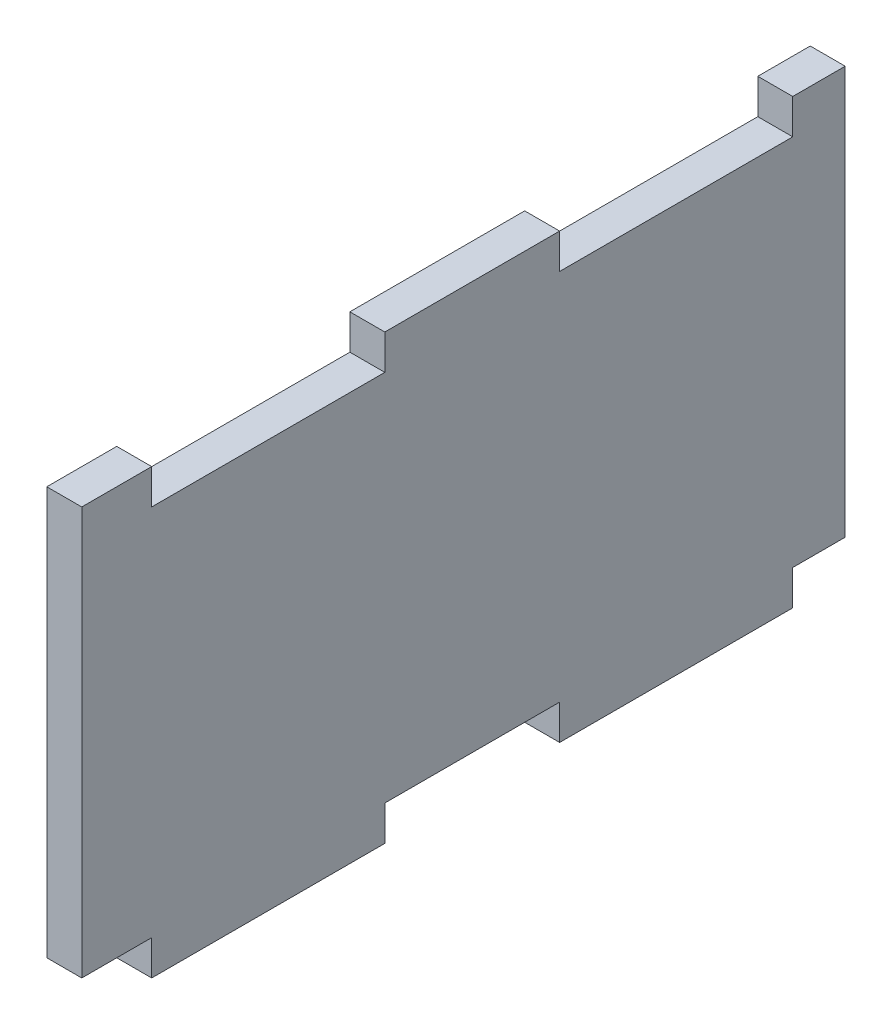
ISO-10303-21;
HEADER;
FILE_DESCRIPTION(('STEP AP214'),'2;1');
FILE_NAME('part.step','',(''),(''),'','','');
FILE_SCHEMA(('AUTOMOTIVE_DESIGN { 1 0 10303 214 1 1 1 1 }'));
ENDSEC;
DATA;
#1=APPLICATION_CONTEXT('core data for automotive mechanical design processes');
#2=APPLICATION_PROTOCOL_DEFINITION('international standard','automotive_design',2000,#1);
#3=PRODUCT_CONTEXT('',#1,'mechanical');
#4=PRODUCT('Part','Part','',(#3));
#5=PRODUCT_RELATED_PRODUCT_CATEGORY('part','',(#4));
#6=PRODUCT_DEFINITION_FORMATION('','',#4);
#7=PRODUCT_DEFINITION_CONTEXT('part definition',#1,'design');
#8=PRODUCT_DEFINITION('design','',#6,#7);
#9=PRODUCT_DEFINITION_SHAPE('','',#8);
#10=(LENGTH_UNIT() NAMED_UNIT(*) SI_UNIT(.MILLI.,.METRE.));
#11=(NAMED_UNIT(*) PLANE_ANGLE_UNIT() SI_UNIT($,.RADIAN.));
#12=(NAMED_UNIT(*) SI_UNIT($,.STERADIAN.) SOLID_ANGLE_UNIT());
#13=UNCERTAINTY_MEASURE_WITH_UNIT(LENGTH_MEASURE(1.E-05),#10,'distance_accuracy_value','');
#14=(GEOMETRIC_REPRESENTATION_CONTEXT(3) GLOBAL_UNCERTAINTY_ASSIGNED_CONTEXT((#13)) GLOBAL_UNIT_ASSIGNED_CONTEXT((#10,
#11,#12)) REPRESENTATION_CONTEXT('',''));
#15=CARTESIAN_POINT('',(0.,0.,0.));
#16=DIRECTION('',(0.,0.,1.));
#17=DIRECTION('',(1.,0.,0.));
#18=AXIS2_PLACEMENT_3D('',#15,#16,#17);
#19=CARTESIAN_POINT('',(3.,0.,0.));
#20=DIRECTION('',(0.,0.,1.));
#21=DIRECTION('',(1.,0.,0.));
#22=AXIS2_PLACEMENT_3D('',#19,#20,#21);
#23=PLANE('',#22);
#24=DIRECTION('',(0.,1.,0.));
#25=VECTOR('',#24,1.);
#26=CARTESIAN_POINT('',(0.,0.,0.));
#27=LINE('',#26,#25);
#28=CARTESIAN_POINT('',(0.,0.,0.));
#29=VERTEX_POINT('',#28);
#30=CARTESIAN_POINT('',(0.,35.,0.));
#31=VERTEX_POINT('',#30);
#32=EDGE_CURVE('E206',#29,#31,#27,.T.);
#33=ORIENTED_EDGE('',*,*,#32,.F.);
#34=DIRECTION('',(-1.,0.,0.));
#35=VECTOR('',#34,1.);
#36=CARTESIAN_POINT('',(3.,0.,0.));
#37=LINE('',#36,#35);
#38=CARTESIAN_POINT('',(3.,0.,0.));
#39=VERTEX_POINT('',#38);
#40=EDGE_CURVE('E42',#39,#29,#37,.T.);
#41=ORIENTED_EDGE('',*,*,#40,.F.);
#42=DIRECTION('',(0.,1.,0.));
#43=VECTOR('',#42,1.);
#44=CARTESIAN_POINT('',(3.,0.,0.));
#45=LINE('',#44,#43);
#46=CARTESIAN_POINT('',(3.,35.,0.));
#47=VERTEX_POINT('',#46);
#48=EDGE_CURVE('E257',#39,#47,#45,.T.);
#49=ORIENTED_EDGE('',*,*,#48,.T.);
#50=DIRECTION('',(-1.,0.,0.));
#51=VECTOR('',#50,1.);
#52=CARTESIAN_POINT('',(3.,35.,0.));
#53=LINE('',#52,#51);
#54=EDGE_CURVE('E124',#47,#31,#53,.T.);
#55=ORIENTED_EDGE('',*,*,#54,.T.);
#56=EDGE_LOOP('',(#33,#41,#49,#55));
#57=FACE_BOUND('',#56,.T.);
#58=ADVANCED_FACE('F35',(#57),#23,.T.);
#59=CARTESIAN_POINT('',(3.,0.,0.));
#60=DIRECTION('',(0.,1.,0.));
#61=DIRECTION('',(0.,0.,1.));
#62=AXIS2_PLACEMENT_3D('',#59,#60,#61);
#63=PLANE('',#62);
#64=DIRECTION('',(0.,0.,-1.));
#65=VECTOR('',#64,1.);
#66=CARTESIAN_POINT('',(0.,0.,0.));
#67=LINE('',#66,#65);
#68=CARTESIAN_POINT('',(0.,0.,-6.));
#69=VERTEX_POINT('',#68);
#70=EDGE_CURVE('E255',#29,#69,#67,.T.);
#71=ORIENTED_EDGE('',*,*,#70,.T.);
#72=DIRECTION('',(-1.,0.,0.));
#73=VECTOR('',#72,1.);
#74=CARTESIAN_POINT('',(3.,0.,-6.));
#75=LINE('',#74,#73);
#76=CARTESIAN_POINT('',(3.,0.,-6.));
#77=VERTEX_POINT('',#76);
#78=EDGE_CURVE('E194',#77,#69,#75,.T.);
#79=ORIENTED_EDGE('',*,*,#78,.F.);
#80=DIRECTION('',(0.,0.,-1.));
#81=VECTOR('',#80,1.);
#82=CARTESIAN_POINT('',(3.,0.,0.));
#83=LINE('',#82,#81);
#84=EDGE_CURVE('E181',#39,#77,#83,.T.);
#85=ORIENTED_EDGE('',*,*,#84,.F.);
#86=ORIENTED_EDGE('',*,*,#40,.T.);
#87=EDGE_LOOP('',(#71,#79,#85,#86));
#88=FACE_BOUND('',#87,.T.);
#89=ADVANCED_FACE('F292',(#88),#63,.F.);
#90=CARTESIAN_POINT('',(3.,0.,-6.));
#91=DIRECTION('',(0.,0.,-1.));
#92=DIRECTION('',(-1.,0.,0.));
#93=AXIS2_PLACEMENT_3D('',#90,#91,#92);
#94=PLANE('',#93);
#95=DIRECTION('',(0.,-1.,0.));
#96=VECTOR('',#95,1.);
#97=CARTESIAN_POINT('',(0.,0.,-6.));
#98=LINE('',#97,#96);
#99=CARTESIAN_POINT('',(0.,-3.00000000000001,-6.));
#100=VERTEX_POINT('',#99);
#101=EDGE_CURVE('E190',#69,#100,#98,.T.);
#102=ORIENTED_EDGE('',*,*,#101,.T.);
#103=DIRECTION('',(-1.,0.,0.));
#104=VECTOR('',#103,1.);
#105=CARTESIAN_POINT('',(3.,-3.00000000000001,-6.));
#106=LINE('',#105,#104);
#107=CARTESIAN_POINT('',(3.,-3.00000000000001,-6.));
#108=VERTEX_POINT('',#107);
#109=EDGE_CURVE('E187',#108,#100,#106,.T.);
#110=ORIENTED_EDGE('',*,*,#109,.F.);
#111=DIRECTION('',(0.,-1.,0.));
#112=VECTOR('',#111,1.);
#113=CARTESIAN_POINT('',(3.,0.,-6.));
#114=LINE('',#113,#112);
#115=EDGE_CURVE('E172',#77,#108,#114,.T.);
#116=ORIENTED_EDGE('',*,*,#115,.F.);
#117=ORIENTED_EDGE('',*,*,#78,.T.);
#118=EDGE_LOOP('',(#102,#110,#116,#117));
#119=FACE_BOUND('',#118,.T.);
#120=ADVANCED_FACE('F188',(#119),#94,.F.);
#121=CARTESIAN_POINT('',(3.,-3.00000000000001,-6.));
#122=DIRECTION('',(0.,1.,0.));
#123=DIRECTION('',(0.,0.,1.));
#124=AXIS2_PLACEMENT_3D('',#121,#122,#123);
#125=PLANE('',#124);
#126=DIRECTION('',(0.,0.,-1.));
#127=VECTOR('',#126,1.);
#128=CARTESIAN_POINT('',(0.,-3.00000000000001,-6.));
#129=LINE('',#128,#127);
#130=CARTESIAN_POINT('',(0.,-3.,-26.));
#131=VERTEX_POINT('',#130);
#132=EDGE_CURVE('E252',#100,#131,#129,.T.);
#133=ORIENTED_EDGE('',*,*,#132,.T.);
#134=DIRECTION('',(-1.,0.,0.));
#135=VECTOR('',#134,1.);
#136=CARTESIAN_POINT('',(3.,-3.,-26.));
#137=LINE('',#136,#135);
#138=CARTESIAN_POINT('',(3.,-3.,-26.));
#139=VERTEX_POINT('',#138);
#140=EDGE_CURVE('E195',#139,#131,#137,.T.);
#141=ORIENTED_EDGE('',*,*,#140,.F.);
#142=DIRECTION('',(0.,0.,-1.));
#143=VECTOR('',#142,1.);
#144=CARTESIAN_POINT('',(3.,-3.00000000000001,-6.));
#145=LINE('',#144,#143);
#146=EDGE_CURVE('E178',#108,#139,#145,.T.);
#147=ORIENTED_EDGE('',*,*,#146,.F.);
#148=ORIENTED_EDGE('',*,*,#109,.T.);
#149=EDGE_LOOP('',(#133,#141,#147,#148));
#150=FACE_BOUND('',#149,.T.);
#151=ADVANCED_FACE('F197',(#150),#125,.F.);
#152=CARTESIAN_POINT('',(3.,0.,-26.));
#153=DIRECTION('',(0.,0.,-1.));
#154=DIRECTION('',(0.,1.,0.));
#155=AXIS2_PLACEMENT_3D('',#152,#153,#154);
#156=PLANE('',#155);
#157=DIRECTION('',(0.,-1.,0.));
#158=VECTOR('',#157,1.);
#159=CARTESIAN_POINT('',(0.,0.,-26.));
#160=LINE('',#159,#158);
#161=CARTESIAN_POINT('',(0.,0.,-26.));
#162=VERTEX_POINT('',#161);
#163=EDGE_CURVE('E249',#162,#131,#160,.T.);
#164=ORIENTED_EDGE('',*,*,#163,.F.);
#165=DIRECTION('',(-1.,0.,0.));
#166=VECTOR('',#165,1.);
#167=CARTESIAN_POINT('',(3.,0.,-26.));
#168=LINE('',#167,#166);
#169=CARTESIAN_POINT('',(3.,0.,-26.));
#170=VERTEX_POINT('',#169);
#171=EDGE_CURVE('E261',#170,#162,#168,.T.);
#172=ORIENTED_EDGE('',*,*,#171,.F.);
#173=DIRECTION('',(0.,-1.,0.));
#174=VECTOR('',#173,1.);
#175=CARTESIAN_POINT('',(3.,0.,-26.));
#176=LINE('',#175,#174);
#177=EDGE_CURVE('E199',#170,#139,#176,.T.);
#178=ORIENTED_EDGE('',*,*,#177,.T.);
#179=ORIENTED_EDGE('',*,*,#140,.T.);
#180=EDGE_LOOP('',(#164,#172,#178,#179));
#181=FACE_BOUND('',#180,.T.);
#182=ADVANCED_FACE('F417',(#181),#156,.T.);
#183=CARTESIAN_POINT('',(3.,0.,-26.));
#184=DIRECTION('',(0.,1.,0.));
#185=DIRECTION('',(0.,0.,1.));
#186=AXIS2_PLACEMENT_3D('',#183,#184,#185);
#187=PLANE('',#186);
#188=DIRECTION('',(0.,0.,-1.));
#189=VECTOR('',#188,1.);
#190=CARTESIAN_POINT('',(0.,0.,-26.));
#191=LINE('',#190,#189);
#192=CARTESIAN_POINT('',(0.,0.,-41.));
#193=VERTEX_POINT('',#192);
#194=EDGE_CURVE('E247',#162,#193,#191,.T.);
#195=ORIENTED_EDGE('',*,*,#194,.T.);
#196=DIRECTION('',(-1.,0.,0.));
#197=VECTOR('',#196,1.);
#198=CARTESIAN_POINT('',(3.,0.,-41.));
#199=LINE('',#198,#197);
#200=CARTESIAN_POINT('',(3.,0.,-41.));
#201=VERTEX_POINT('',#200);
#202=EDGE_CURVE('E263',#201,#193,#199,.T.);
#203=ORIENTED_EDGE('',*,*,#202,.F.);
#204=DIRECTION('',(0.,0.,-1.));
#205=VECTOR('',#204,1.);
#206=CARTESIAN_POINT('',(3.,0.,-26.));
#207=LINE('',#206,#205);
#208=EDGE_CURVE('E201',#170,#201,#207,.T.);
#209=ORIENTED_EDGE('',*,*,#208,.F.);
#210=ORIENTED_EDGE('',*,*,#171,.T.);
#211=EDGE_LOOP('',(#195,#203,#209,#210));
#212=FACE_BOUND('',#211,.T.);
#213=ADVANCED_FACE('F335',(#212),#187,.F.);
#214=CARTESIAN_POINT('',(3.,0.,-41.));
#215=DIRECTION('',(0.,0.,-1.));
#216=DIRECTION('',(-1.,0.,0.));
#217=AXIS2_PLACEMENT_3D('',#214,#215,#216);
#218=PLANE('',#217);
#219=DIRECTION('',(0.,-1.,0.));
#220=VECTOR('',#219,1.);
#221=CARTESIAN_POINT('',(0.,0.,-41.));
#222=LINE('',#221,#220);
#223=CARTESIAN_POINT('',(0.,-3.00000000000001,-41.));
#224=VERTEX_POINT('',#223);
#225=EDGE_CURVE('E245',#193,#224,#222,.T.);
#226=ORIENTED_EDGE('',*,*,#225,.T.);
#227=DIRECTION('',(-1.,0.,0.));
#228=VECTOR('',#227,1.);
#229=CARTESIAN_POINT('',(3.,-3.00000000000001,-41.));
#230=LINE('',#229,#228);
#231=CARTESIAN_POINT('',(3.,-3.00000000000001,-41.));
#232=VERTEX_POINT('',#231);
#233=EDGE_CURVE('E266',#232,#224,#230,.T.);
#234=ORIENTED_EDGE('',*,*,#233,.F.);
#235=DIRECTION('',(0.,-1.,0.));
#236=VECTOR('',#235,1.);
#237=CARTESIAN_POINT('',(3.,0.,-41.));
#238=LINE('',#237,#236);
#239=EDGE_CURVE('E329',#201,#232,#238,.T.);
#240=ORIENTED_EDGE('',*,*,#239,.F.);
#241=ORIENTED_EDGE('',*,*,#202,.T.);
#242=EDGE_LOOP('',(#226,#234,#240,#241));
#243=FACE_BOUND('',#242,.T.);
#244=ADVANCED_FACE('F339',(#243),#218,.F.);
#245=CARTESIAN_POINT('',(3.,-3.00000000000001,-41.));
#246=DIRECTION('',(0.,1.,0.));
#247=DIRECTION('',(0.,0.,1.));
#248=AXIS2_PLACEMENT_3D('',#245,#246,#247);
#249=PLANE('',#248);
#250=DIRECTION('',(0.,0.,-1.));
#251=VECTOR('',#250,1.);
#252=CARTESIAN_POINT('',(0.,-3.00000000000001,-41.));
#253=LINE('',#252,#251);
#254=CARTESIAN_POINT('',(0.,-3.,-61.));
#255=VERTEX_POINT('',#254);
#256=EDGE_CURVE('E242',#224,#255,#253,.T.);
#257=ORIENTED_EDGE('',*,*,#256,.T.);
#258=DIRECTION('',(-1.,0.,0.));
#259=VECTOR('',#258,1.);
#260=CARTESIAN_POINT('',(3.,-3.,-61.));
#261=LINE('',#260,#259);
#262=CARTESIAN_POINT('',(3.,-3.,-61.));
#263=VERTEX_POINT('',#262);
#264=EDGE_CURVE('E269',#263,#255,#261,.T.);
#265=ORIENTED_EDGE('',*,*,#264,.F.);
#266=DIRECTION('',(0.,0.,-1.));
#267=VECTOR('',#266,1.);
#268=CARTESIAN_POINT('',(3.,-3.00000000000001,-41.));
#269=LINE('',#268,#267);
#270=EDGE_CURVE('E327',#232,#263,#269,.T.);
#271=ORIENTED_EDGE('',*,*,#270,.F.);
#272=ORIENTED_EDGE('',*,*,#233,.T.);
#273=EDGE_LOOP('',(#257,#265,#271,#272));
#274=FACE_BOUND('',#273,.T.);
#275=ADVANCED_FACE('F344',(#274),#249,.F.);
#276=CARTESIAN_POINT('',(3.,0.,-61.));
#277=DIRECTION('',(0.,0.,-1.));
#278=DIRECTION('',(0.,1.,0.));
#279=AXIS2_PLACEMENT_3D('',#276,#277,#278);
#280=PLANE('',#279);
#281=DIRECTION('',(0.,-1.,0.));
#282=VECTOR('',#281,1.);
#283=CARTESIAN_POINT('',(0.,0.,-61.));
#284=LINE('',#283,#282);
#285=CARTESIAN_POINT('',(0.,0.,-61.));
#286=VERTEX_POINT('',#285);
#287=EDGE_CURVE('E239',#286,#255,#284,.T.);
#288=ORIENTED_EDGE('',*,*,#287,.F.);
#289=DIRECTION('',(-1.,0.,0.));
#290=VECTOR('',#289,1.);
#291=CARTESIAN_POINT('',(3.,0.,-61.));
#292=LINE('',#291,#290);
#293=CARTESIAN_POINT('',(3.,0.,-61.));
#294=VERTEX_POINT('',#293);
#295=EDGE_CURVE('E271',#294,#286,#292,.T.);
#296=ORIENTED_EDGE('',*,*,#295,.F.);
#297=DIRECTION('',(0.,-1.,0.));
#298=VECTOR('',#297,1.);
#299=CARTESIAN_POINT('',(3.,0.,-61.));
#300=LINE('',#299,#298);
#301=EDGE_CURVE('E324',#294,#263,#300,.T.);
#302=ORIENTED_EDGE('',*,*,#301,.T.);
#303=ORIENTED_EDGE('',*,*,#264,.T.);
#304=EDGE_LOOP('',(#288,#296,#302,#303));
#305=FACE_BOUND('',#304,.T.);
#306=ADVANCED_FACE('F351',(#305),#280,.T.);
#307=CARTESIAN_POINT('',(3.,0.,-61.));
#308=DIRECTION('',(0.,1.,0.));
#309=DIRECTION('',(0.,0.,1.));
#310=AXIS2_PLACEMENT_3D('',#307,#308,#309);
#311=PLANE('',#310);
#312=DIRECTION('',(0.,0.,-1.));
#313=VECTOR('',#312,1.);
#314=CARTESIAN_POINT('',(0.,0.,-61.));
#315=LINE('',#314,#313);
#316=CARTESIAN_POINT('',(0.,0.,-65.5));
#317=VERTEX_POINT('',#316);
#318=EDGE_CURVE('E236',#286,#317,#315,.T.);
#319=ORIENTED_EDGE('',*,*,#318,.T.);
#320=DIRECTION('',(1.,0.,0.));
#321=VECTOR('',#320,1.);
#322=CARTESIAN_POINT('',(3.,0.,-65.5));
#323=LINE('',#322,#321);
#324=CARTESIAN_POINT('',(3.,0.,-65.5));
#325=VERTEX_POINT('',#324);
#326=EDGE_CURVE('E48',#317,#325,#323,.T.);
#327=ORIENTED_EDGE('',*,*,#326,.T.);
#328=DIRECTION('',(0.,0.,-1.));
#329=VECTOR('',#328,1.);
#330=CARTESIAN_POINT('',(3.,0.,-61.));
#331=LINE('',#330,#329);
#332=EDGE_CURVE('E322',#294,#325,#331,.T.);
#333=ORIENTED_EDGE('',*,*,#332,.F.);
#334=ORIENTED_EDGE('',*,*,#295,.T.);
#335=EDGE_LOOP('',(#319,#327,#333,#334));
#336=FACE_BOUND('',#335,.T.);
#337=ADVANCED_FACE('F354',(#336),#311,.F.);
#338=CARTESIAN_POINT('',(3.,35.,-61.));
#339=DIRECTION('',(0.,1.,0.));
#340=DIRECTION('',(0.,0.,1.));
#341=AXIS2_PLACEMENT_3D('',#338,#339,#340);
#342=PLANE('',#341);
#343=DIRECTION('',(1.,0.,0.));
#344=VECTOR('',#343,1.);
#345=CARTESIAN_POINT('',(3.,35.,-65.5));
#346=LINE('',#345,#344);
#347=CARTESIAN_POINT('',(0.,35.,-65.5));
#348=VERTEX_POINT('',#347);
#349=CARTESIAN_POINT('',(3.,35.,-65.5));
#350=VERTEX_POINT('',#349);
#351=EDGE_CURVE('E356',#348,#350,#346,.T.);
#352=ORIENTED_EDGE('',*,*,#351,.F.);
#353=DIRECTION('',(0.,0.,-1.));
#354=VECTOR('',#353,1.);
#355=CARTESIAN_POINT('',(0.,35.,-61.));
#356=LINE('',#355,#354);
#357=CARTESIAN_POINT('',(0.,35.,-61.));
#358=VERTEX_POINT('',#357);
#359=EDGE_CURVE('E233',#358,#348,#356,.T.);
#360=ORIENTED_EDGE('',*,*,#359,.F.);
#361=DIRECTION('',(-1.,0.,0.));
#362=VECTOR('',#361,1.);
#363=CARTESIAN_POINT('',(3.,35.,-61.));
#364=LINE('',#363,#362);
#365=CARTESIAN_POINT('',(3.,35.,-61.));
#366=VERTEX_POINT('',#365);
#367=EDGE_CURVE('E273',#366,#358,#364,.T.);
#368=ORIENTED_EDGE('',*,*,#367,.F.);
#369=DIRECTION('',(0.,0.,-1.));
#370=VECTOR('',#369,1.);
#371=CARTESIAN_POINT('',(3.,35.,-61.));
#372=LINE('',#371,#370);
#373=EDGE_CURVE('E319',#366,#350,#372,.T.);
#374=ORIENTED_EDGE('',*,*,#373,.T.);
#375=EDGE_LOOP('',(#352,#360,#368,#374));
#376=FACE_BOUND('',#375,.T.);
#377=ADVANCED_FACE('F365',(#376),#342,.T.);
#378=CARTESIAN_POINT('',(3.,35.,-61.));
#379=DIRECTION('',(0.,0.,-1.));
#380=DIRECTION('',(0.,1.,0.));
#381=AXIS2_PLACEMENT_3D('',#378,#379,#380);
#382=PLANE('',#381);
#383=DIRECTION('',(0.,-1.,0.));
#384=VECTOR('',#383,1.);
#385=CARTESIAN_POINT('',(0.,35.,-61.));
#386=LINE('',#385,#384);
#387=CARTESIAN_POINT('',(0.,32.,-61.));
#388=VERTEX_POINT('',#387);
#389=EDGE_CURVE('E230',#358,#388,#386,.T.);
#390=ORIENTED_EDGE('',*,*,#389,.T.);
#391=DIRECTION('',(-1.,0.,0.));
#392=VECTOR('',#391,1.);
#393=CARTESIAN_POINT('',(3.,32.,-61.));
#394=LINE('',#393,#392);
#395=CARTESIAN_POINT('',(3.,32.,-61.));
#396=VERTEX_POINT('',#395);
#397=EDGE_CURVE('E275',#396,#388,#394,.T.);
#398=ORIENTED_EDGE('',*,*,#397,.F.);
#399=DIRECTION('',(0.,-1.,0.));
#400=VECTOR('',#399,1.);
#401=CARTESIAN_POINT('',(3.,35.,-61.));
#402=LINE('',#401,#400);
#403=EDGE_CURVE('E317',#366,#396,#402,.T.);
#404=ORIENTED_EDGE('',*,*,#403,.F.);
#405=ORIENTED_EDGE('',*,*,#367,.T.);
#406=EDGE_LOOP('',(#390,#398,#404,#405));
#407=FACE_BOUND('',#406,.T.);
#408=ADVANCED_FACE('F371',(#407),#382,.F.);
#409=CARTESIAN_POINT('',(3.,32.,-41.));
#410=DIRECTION('',(0.,1.,0.));
#411=DIRECTION('',(0.,0.,1.));
#412=AXIS2_PLACEMENT_3D('',#409,#410,#411);
#413=PLANE('',#412);
#414=DIRECTION('',(0.,0.,-1.));
#415=VECTOR('',#414,1.);
#416=CARTESIAN_POINT('',(0.,32.,-41.));
#417=LINE('',#416,#415);
#418=CARTESIAN_POINT('',(0.,32.,-41.));
#419=VERTEX_POINT('',#418);
#420=EDGE_CURVE('E227',#419,#388,#417,.T.);
#421=ORIENTED_EDGE('',*,*,#420,.F.);
#422=DIRECTION('',(-1.,0.,0.));
#423=VECTOR('',#422,1.);
#424=CARTESIAN_POINT('',(3.,32.,-41.));
#425=LINE('',#424,#423);
#426=CARTESIAN_POINT('',(3.,32.,-41.));
#427=VERTEX_POINT('',#426);
#428=EDGE_CURVE('E277',#427,#419,#425,.T.);
#429=ORIENTED_EDGE('',*,*,#428,.F.);
#430=DIRECTION('',(0.,0.,-1.));
#431=VECTOR('',#430,1.);
#432=CARTESIAN_POINT('',(3.,32.,-41.));
#433=LINE('',#432,#431);
#434=EDGE_CURVE('E314',#427,#396,#433,.T.);
#435=ORIENTED_EDGE('',*,*,#434,.T.);
#436=ORIENTED_EDGE('',*,*,#397,.T.);
#437=EDGE_LOOP('',(#421,#429,#435,#436));
#438=FACE_BOUND('',#437,.T.);
#439=ADVANCED_FACE('F394',(#438),#413,.T.);
#440=CARTESIAN_POINT('',(3.,35.,-41.));
#441=DIRECTION('',(0.,0.,-1.));
#442=DIRECTION('',(0.,1.,0.));
#443=AXIS2_PLACEMENT_3D('',#440,#441,#442);
#444=PLANE('',#443);
#445=DIRECTION('',(0.,-1.,0.));
#446=VECTOR('',#445,1.);
#447=CARTESIAN_POINT('',(0.,35.,-41.));
#448=LINE('',#447,#446);
#449=CARTESIAN_POINT('',(0.,35.,-41.));
#450=VERTEX_POINT('',#449);
#451=EDGE_CURVE('E224',#450,#419,#448,.T.);
#452=ORIENTED_EDGE('',*,*,#451,.F.);
#453=DIRECTION('',(-1.,0.,0.));
#454=VECTOR('',#453,1.);
#455=CARTESIAN_POINT('',(3.,35.,-41.));
#456=LINE('',#455,#454);
#457=CARTESIAN_POINT('',(3.,35.,-41.));
#458=VERTEX_POINT('',#457);
#459=EDGE_CURVE('E279',#458,#450,#456,.T.);
#460=ORIENTED_EDGE('',*,*,#459,.F.);
#461=DIRECTION('',(0.,-1.,0.));
#462=VECTOR('',#461,1.);
#463=CARTESIAN_POINT('',(3.,35.,-41.));
#464=LINE('',#463,#462);
#465=EDGE_CURVE('E311',#458,#427,#464,.T.);
#466=ORIENTED_EDGE('',*,*,#465,.T.);
#467=ORIENTED_EDGE('',*,*,#428,.T.);
#468=EDGE_LOOP('',(#452,#460,#466,#467));
#469=FACE_BOUND('',#468,.T.);
#470=ADVANCED_FACE('F378',(#469),#444,.T.);
#471=CARTESIAN_POINT('',(3.,35.,-26.));
#472=DIRECTION('',(0.,1.,0.));
#473=DIRECTION('',(0.,0.,1.));
#474=AXIS2_PLACEMENT_3D('',#471,#472,#473);
#475=PLANE('',#474);
#476=DIRECTION('',(0.,0.,-1.));
#477=VECTOR('',#476,1.);
#478=CARTESIAN_POINT('',(0.,35.,-26.));
#479=LINE('',#478,#477);
#480=CARTESIAN_POINT('',(0.,35.,-26.));
#481=VERTEX_POINT('',#480);
#482=EDGE_CURVE('E221',#481,#450,#479,.T.);
#483=ORIENTED_EDGE('',*,*,#482,.F.);
#484=DIRECTION('',(-1.,0.,0.));
#485=VECTOR('',#484,1.);
#486=CARTESIAN_POINT('',(3.,35.,-26.));
#487=LINE('',#486,#485);
#488=CARTESIAN_POINT('',(3.,35.,-26.));
#489=VERTEX_POINT('',#488);
#490=EDGE_CURVE('E281',#489,#481,#487,.T.);
#491=ORIENTED_EDGE('',*,*,#490,.F.);
#492=DIRECTION('',(0.,0.,-1.));
#493=VECTOR('',#492,1.);
#494=CARTESIAN_POINT('',(3.,35.,-26.));
#495=LINE('',#494,#493);
#496=EDGE_CURVE('E308',#489,#458,#495,.T.);
#497=ORIENTED_EDGE('',*,*,#496,.T.);
#498=ORIENTED_EDGE('',*,*,#459,.T.);
#499=EDGE_LOOP('',(#483,#491,#497,#498));
#500=FACE_BOUND('',#499,.T.);
#501=ADVANCED_FACE('F382',(#500),#475,.T.);
#502=CARTESIAN_POINT('',(3.,35.,-26.));
#503=DIRECTION('',(0.,0.,-1.));
#504=DIRECTION('',(0.,1.,0.));
#505=AXIS2_PLACEMENT_3D('',#502,#503,#504);
#506=PLANE('',#505);
#507=DIRECTION('',(0.,-1.,0.));
#508=VECTOR('',#507,1.);
#509=CARTESIAN_POINT('',(0.,35.,-26.));
#510=LINE('',#509,#508);
#511=CARTESIAN_POINT('',(0.,32.,-26.));
#512=VERTEX_POINT('',#511);
#513=EDGE_CURVE('E218',#481,#512,#510,.T.);
#514=ORIENTED_EDGE('',*,*,#513,.T.);
#515=DIRECTION('',(-1.,0.,0.));
#516=VECTOR('',#515,1.);
#517=CARTESIAN_POINT('',(3.,32.,-26.));
#518=LINE('',#517,#516);
#519=CARTESIAN_POINT('',(3.,32.,-26.));
#520=VERTEX_POINT('',#519);
#521=EDGE_CURVE('E283',#520,#512,#518,.T.);
#522=ORIENTED_EDGE('',*,*,#521,.F.);
#523=DIRECTION('',(0.,-1.,0.));
#524=VECTOR('',#523,1.);
#525=CARTESIAN_POINT('',(3.,35.,-26.));
#526=LINE('',#525,#524);
#527=EDGE_CURVE('E306',#489,#520,#526,.T.);
#528=ORIENTED_EDGE('',*,*,#527,.F.);
#529=ORIENTED_EDGE('',*,*,#490,.T.);
#530=EDGE_LOOP('',(#514,#522,#528,#529));
#531=FACE_BOUND('',#530,.T.);
#532=ADVANCED_FACE('F387',(#531),#506,.F.);
#533=CARTESIAN_POINT('',(3.,32.,-6.));
#534=DIRECTION('',(0.,1.,0.));
#535=DIRECTION('',(0.,0.,1.));
#536=AXIS2_PLACEMENT_3D('',#533,#534,#535);
#537=PLANE('',#536);
#538=DIRECTION('',(0.,0.,-1.));
#539=VECTOR('',#538,1.);
#540=CARTESIAN_POINT('',(0.,32.,-6.));
#541=LINE('',#540,#539);
#542=CARTESIAN_POINT('',(0.,32.,-6.));
#543=VERTEX_POINT('',#542);
#544=EDGE_CURVE('E215',#543,#512,#541,.T.);
#545=ORIENTED_EDGE('',*,*,#544,.F.);
#546=DIRECTION('',(-1.,0.,0.));
#547=VECTOR('',#546,1.);
#548=CARTESIAN_POINT('',(3.,32.,-6.));
#549=LINE('',#548,#547);
#550=CARTESIAN_POINT('',(3.,32.,-6.));
#551=VERTEX_POINT('',#550);
#552=EDGE_CURVE('E285',#551,#543,#549,.T.);
#553=ORIENTED_EDGE('',*,*,#552,.F.);
#554=DIRECTION('',(0.,0.,-1.));
#555=VECTOR('',#554,1.);
#556=CARTESIAN_POINT('',(3.,32.,-6.));
#557=LINE('',#556,#555);
#558=EDGE_CURVE('E303',#551,#520,#557,.T.);
#559=ORIENTED_EDGE('',*,*,#558,.T.);
#560=ORIENTED_EDGE('',*,*,#521,.T.);
#561=EDGE_LOOP('',(#545,#553,#559,#560));
#562=FACE_BOUND('',#561,.T.);
#563=ADVANCED_FACE('F391',(#562),#537,.T.);
#564=CARTESIAN_POINT('',(3.,35.,-6.00000000000001));
#565=DIRECTION('',(0.,0.,-1.));
#566=DIRECTION('',(0.,1.,0.));
#567=AXIS2_PLACEMENT_3D('',#564,#565,#566);
#568=PLANE('',#567);
#569=DIRECTION('',(0.,-1.,0.));
#570=VECTOR('',#569,1.);
#571=CARTESIAN_POINT('',(0.,35.,-6.00000000000001));
#572=LINE('',#571,#570);
#573=CARTESIAN_POINT('',(0.,35.,-6.00000000000001));
#574=VERTEX_POINT('',#573);
#575=EDGE_CURVE('E212',#574,#543,#572,.T.);
#576=ORIENTED_EDGE('',*,*,#575,.F.);
#577=DIRECTION('',(-1.,0.,0.));
#578=VECTOR('',#577,1.);
#579=CARTESIAN_POINT('',(3.,35.,-6.00000000000001));
#580=LINE('',#579,#578);
#581=CARTESIAN_POINT('',(3.,35.,-6.00000000000001));
#582=VERTEX_POINT('',#581);
#583=EDGE_CURVE('E287',#582,#574,#580,.T.);
#584=ORIENTED_EDGE('',*,*,#583,.F.);
#585=DIRECTION('',(0.,-1.,0.));
#586=VECTOR('',#585,1.);
#587=CARTESIAN_POINT('',(3.,35.,-6.00000000000001));
#588=LINE('',#587,#586);
#589=EDGE_CURVE('E296',#582,#551,#588,.T.);
#590=ORIENTED_EDGE('',*,*,#589,.T.);
#591=ORIENTED_EDGE('',*,*,#552,.T.);
#592=EDGE_LOOP('',(#576,#584,#590,#591));
#593=FACE_BOUND('',#592,.T.);
#594=ADVANCED_FACE('F393',(#593),#568,.T.);
#595=CARTESIAN_POINT('',(3.,35.,0.));
#596=DIRECTION('',(0.,1.,0.));
#597=DIRECTION('',(0.,0.,1.));
#598=AXIS2_PLACEMENT_3D('',#595,#596,#597);
#599=PLANE('',#598);
#600=DIRECTION('',(0.,0.,-1.));
#601=VECTOR('',#600,1.);
#602=CARTESIAN_POINT('',(0.,35.,0.));
#603=LINE('',#602,#601);
#604=EDGE_CURVE('E209',#31,#574,#603,.T.);
#605=ORIENTED_EDGE('',*,*,#604,.F.);
#606=ORIENTED_EDGE('',*,*,#54,.F.);
#607=DIRECTION('',(0.,0.,-1.));
#608=VECTOR('',#607,1.);
#609=CARTESIAN_POINT('',(3.,35.,0.));
#610=LINE('',#609,#608);
#611=EDGE_CURVE('E294',#47,#582,#610,.T.);
#612=ORIENTED_EDGE('',*,*,#611,.T.);
#613=ORIENTED_EDGE('',*,*,#583,.T.);
#614=EDGE_LOOP('',(#605,#606,#612,#613));
#615=FACE_BOUND('',#614,.T.);
#616=ADVANCED_FACE('F288',(#615),#599,.T.);
#617=CARTESIAN_POINT('',(3.,0.,0.));
#618=DIRECTION('',(-1.,0.,0.));
#619=DIRECTION('',(0.,0.,1.));
#620=AXIS2_PLACEMENT_3D('',#617,#618,#619);
#621=PLANE('',#620);
#622=ORIENTED_EDGE('',*,*,#332,.T.);
#623=DIRECTION('',(0.,-1.,0.));
#624=VECTOR('',#623,1.);
#625=CARTESIAN_POINT('',(3.,40.,-65.5));
#626=LINE('',#625,#624);
#627=EDGE_CURVE('E358',#350,#325,#626,.T.);
#628=ORIENTED_EDGE('',*,*,#627,.F.);
#629=ORIENTED_EDGE('',*,*,#373,.F.);
#630=ORIENTED_EDGE('',*,*,#403,.T.);
#631=ORIENTED_EDGE('',*,*,#434,.F.);
#632=ORIENTED_EDGE('',*,*,#465,.F.);
#633=ORIENTED_EDGE('',*,*,#496,.F.);
#634=ORIENTED_EDGE('',*,*,#527,.T.);
#635=ORIENTED_EDGE('',*,*,#558,.F.);
#636=ORIENTED_EDGE('',*,*,#589,.F.);
#637=ORIENTED_EDGE('',*,*,#611,.F.);
#638=ORIENTED_EDGE('',*,*,#48,.F.);
#639=ORIENTED_EDGE('',*,*,#84,.T.);
#640=ORIENTED_EDGE('',*,*,#115,.T.);
#641=ORIENTED_EDGE('',*,*,#146,.T.);
#642=ORIENTED_EDGE('',*,*,#177,.F.);
#643=ORIENTED_EDGE('',*,*,#208,.T.);
#644=ORIENTED_EDGE('',*,*,#239,.T.);
#645=ORIENTED_EDGE('',*,*,#270,.T.);
#646=ORIENTED_EDGE('',*,*,#301,.F.);
#647=EDGE_LOOP('',(#622,#628,#629,#630,#631,#632,#633,#634,#635,#636,#637,#638,#639,#640,#641,
#642,#643,#644,#645,#646));
#648=FACE_BOUND('',#647,.T.);
#649=ADVANCED_FACE('F175',(#648),#621,.F.);
#650=CARTESIAN_POINT('',(0.,0.,0.));
#651=DIRECTION('',(-1.,0.,0.));
#652=DIRECTION('',(0.,0.,1.));
#653=AXIS2_PLACEMENT_3D('',#650,#651,#652);
#654=PLANE('',#653);
#655=DIRECTION('',(0.,1.,0.));
#656=VECTOR('',#655,1.);
#657=CARTESIAN_POINT('',(0.,0.,-65.5));
#658=LINE('',#657,#656);
#659=EDGE_CURVE('E11',#317,#348,#658,.T.);
#660=ORIENTED_EDGE('',*,*,#659,.F.);
#661=ORIENTED_EDGE('',*,*,#318,.F.);
#662=ORIENTED_EDGE('',*,*,#287,.T.);
#663=ORIENTED_EDGE('',*,*,#256,.F.);
#664=ORIENTED_EDGE('',*,*,#225,.F.);
#665=ORIENTED_EDGE('',*,*,#194,.F.);
#666=ORIENTED_EDGE('',*,*,#163,.T.);
#667=ORIENTED_EDGE('',*,*,#132,.F.);
#668=ORIENTED_EDGE('',*,*,#101,.F.);
#669=ORIENTED_EDGE('',*,*,#70,.F.);
#670=ORIENTED_EDGE('',*,*,#32,.T.);
#671=ORIENTED_EDGE('',*,*,#604,.T.);
#672=ORIENTED_EDGE('',*,*,#575,.T.);
#673=ORIENTED_EDGE('',*,*,#544,.T.);
#674=ORIENTED_EDGE('',*,*,#513,.F.);
#675=ORIENTED_EDGE('',*,*,#482,.T.);
#676=ORIENTED_EDGE('',*,*,#451,.T.);
#677=ORIENTED_EDGE('',*,*,#420,.T.);
#678=ORIENTED_EDGE('',*,*,#389,.F.);
#679=ORIENTED_EDGE('',*,*,#359,.T.);
#680=EDGE_LOOP('',(#660,#661,#662,#663,#664,#665,#666,#667,#668,#669,#670,#671,#672,#673,#674,
#675,#676,#677,#678,#679));
#681=FACE_BOUND('',#680,.T.);
#682=ADVANCED_FACE('F291',(#681),#654,.T.);
#683=CARTESIAN_POINT('',(-7.,40.,-65.5));
#684=DIRECTION('',(0.,0.,1.));
#685=DIRECTION('',(1.,0.,0.));
#686=AXIS2_PLACEMENT_3D('',#683,#684,#685);
#687=PLANE('',#686);
#688=ORIENTED_EDGE('',*,*,#659,.T.);
#689=ORIENTED_EDGE('',*,*,#351,.T.);
#690=ORIENTED_EDGE('',*,*,#627,.T.);
#691=ORIENTED_EDGE('',*,*,#326,.F.);
#692=EDGE_LOOP('',(#688,#689,#690,#691));
#693=FACE_BOUND('',#692,.T.);
#694=ADVANCED_FACE('F361',(#693),#687,.F.);
#695=CLOSED_SHELL('',(#58,#89,#120,#151,#182,#213,#244,#275,#306,#337,#377,#408,#439,#470,#501,
#532,#563,#594,#616,#649,#682,#694));
#696=MANIFOLD_SOLID_BREP('B2',#695);
#697=ADVANCED_BREP_SHAPE_REPRESENTATION('',(#18,#696),#14);
#698=SHAPE_DEFINITION_REPRESENTATION(#9,#697);
ENDSEC;
END-ISO-10303-21;
